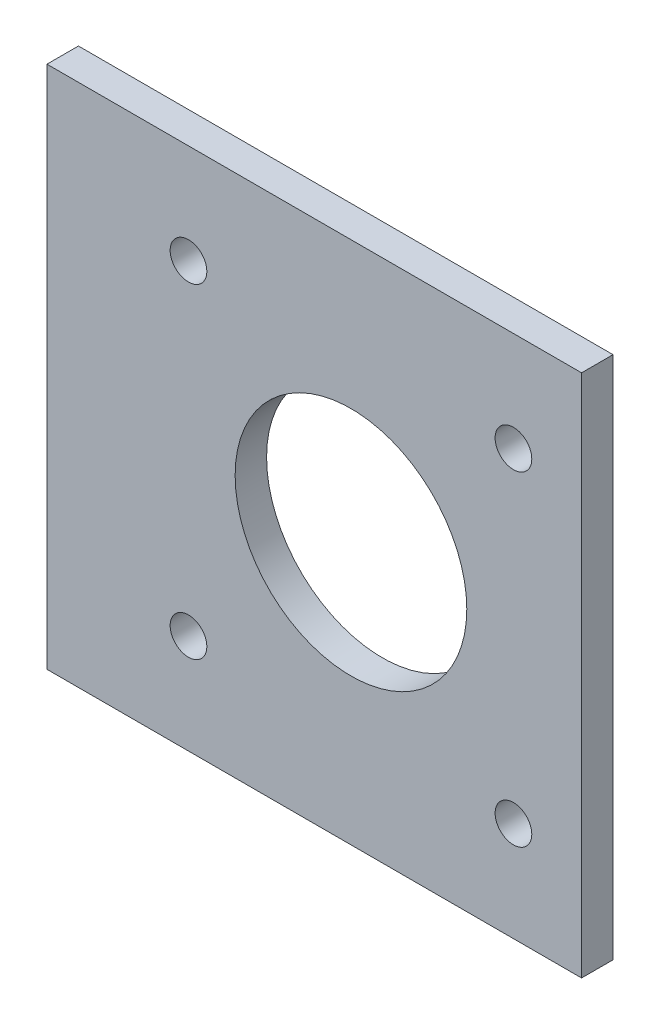
ISO-10303-21;
HEADER;
FILE_DESCRIPTION(('STEP AP214'),'2;1');
FILE_NAME('part.step','',(''),(''),'','','');
FILE_SCHEMA(('AUTOMOTIVE_DESIGN { 1 0 10303 214 1 1 1 1 }'));
ENDSEC;
DATA;
#1=APPLICATION_CONTEXT('core data for automotive mechanical design processes');
#2=APPLICATION_PROTOCOL_DEFINITION('international standard','automotive_design',2000,#1);
#3=PRODUCT_CONTEXT('',#1,'mechanical');
#4=PRODUCT('Part','Part','',(#3));
#5=PRODUCT_RELATED_PRODUCT_CATEGORY('part','',(#4));
#6=PRODUCT_DEFINITION_FORMATION('','',#4);
#7=PRODUCT_DEFINITION_CONTEXT('part definition',#1,'design');
#8=PRODUCT_DEFINITION('design','',#6,#7);
#9=PRODUCT_DEFINITION_SHAPE('','',#8);
#10=(LENGTH_UNIT() NAMED_UNIT(*) SI_UNIT(.MILLI.,.METRE.));
#11=(NAMED_UNIT(*) PLANE_ANGLE_UNIT() SI_UNIT($,.RADIAN.));
#12=(NAMED_UNIT(*) SI_UNIT($,.STERADIAN.) SOLID_ANGLE_UNIT());
#13=UNCERTAINTY_MEASURE_WITH_UNIT(LENGTH_MEASURE(1.E-05),#10,'distance_accuracy_value','');
#14=(GEOMETRIC_REPRESENTATION_CONTEXT(3) GLOBAL_UNCERTAINTY_ASSIGNED_CONTEXT((#13)) GLOBAL_UNIT_ASSIGNED_CONTEXT((#10,
#11,#12)) REPRESENTATION_CONTEXT('',''));
#15=CARTESIAN_POINT('',(0.,0.,0.));
#16=DIRECTION('',(0.,0.,1.));
#17=DIRECTION('',(1.,0.,0.));
#18=AXIS2_PLACEMENT_3D('',#15,#16,#17);
#19=CARTESIAN_POINT('',(0.,0.,3.));
#20=DIRECTION('',(0.,0.,1.));
#21=DIRECTION('',(1.,0.,0.));
#22=AXIS2_PLACEMENT_3D('',#19,#20,#21);
#23=PLANE('',#22);
#24=CARTESIAN_POINT('',(13.5,-9.5,3.));
#25=DIRECTION('',(0.,0.,1.));
#26=DIRECTION('',(1.,0.,0.));
#27=AXIS2_PLACEMENT_3D('',#24,#25,#26);
#28=CIRCLE('',#27,1.75);
#29=CARTESIAN_POINT('',(15.25,-9.5,3.));
#30=VERTEX_POINT('',#29);
#31=EDGE_CURVE('E131',#30,#30,#28,.T.);
#32=ORIENTED_EDGE('',*,*,#31,.F.);
#33=EDGE_LOOP('',(#32));
#34=FACE_BOUND('',#33,.T.);
#35=CARTESIAN_POINT('',(44.5,-40.5,3.));
#36=DIRECTION('',(0.,0.,1.));
#37=DIRECTION('',(1.,0.,0.));
#38=AXIS2_PLACEMENT_3D('',#35,#36,#37);
#39=CIRCLE('',#38,1.75);
#40=CARTESIAN_POINT('',(46.25,-40.5,3.));
#41=VERTEX_POINT('',#40);
#42=EDGE_CURVE('E119',#41,#41,#39,.T.);
#43=ORIENTED_EDGE('',*,*,#42,.F.);
#44=EDGE_LOOP('',(#43));
#45=FACE_BOUND('',#44,.T.);
#46=DIRECTION('',(0.,-1.,0.));
#47=VECTOR('',#46,1.);
#48=CARTESIAN_POINT('',(0.,0.,3.));
#49=LINE('',#48,#47);
#50=CARTESIAN_POINT('',(0.,0.,3.));
#51=VERTEX_POINT('',#50);
#52=CARTESIAN_POINT('',(0.,-50.,3.));
#53=VERTEX_POINT('',#52);
#54=EDGE_CURVE('E89',#51,#53,#49,.T.);
#55=ORIENTED_EDGE('',*,*,#54,.T.);
#56=DIRECTION('',(1.,0.,0.));
#57=VECTOR('',#56,1.);
#58=CARTESIAN_POINT('',(0.,-50.,3.));
#59=LINE('',#58,#57);
#60=CARTESIAN_POINT('',(51.,-50.,3.));
#61=VERTEX_POINT('',#60);
#62=EDGE_CURVE('E84',#53,#61,#59,.T.);
#63=ORIENTED_EDGE('',*,*,#62,.T.);
#64=DIRECTION('',(0.,1.,0.));
#65=VECTOR('',#64,1.);
#66=CARTESIAN_POINT('',(51.,0.,3.));
#67=LINE('',#66,#65);
#68=CARTESIAN_POINT('',(51.,0.,3.));
#69=VERTEX_POINT('',#68);
#70=EDGE_CURVE('E87',#61,#69,#67,.T.);
#71=ORIENTED_EDGE('',*,*,#70,.T.);
#72=DIRECTION('',(-1.,0.,0.));
#73=VECTOR('',#72,1.);
#74=CARTESIAN_POINT('',(0.,0.,3.));
#75=LINE('',#74,#73);
#76=EDGE_CURVE('E54',#69,#51,#75,.T.);
#77=ORIENTED_EDGE('',*,*,#76,.T.);
#78=EDGE_LOOP('',(#55,#63,#71,#77));
#79=FACE_BOUND('',#78,.T.);
#80=CARTESIAN_POINT('',(29.,-25.,3.));
#81=DIRECTION('',(0.,0.,1.));
#82=DIRECTION('',(1.,0.,0.));
#83=AXIS2_PLACEMENT_3D('',#80,#81,#82);
#84=CIRCLE('',#83,11.05);
#85=CARTESIAN_POINT('',(40.05,-25.,3.));
#86=VERTEX_POINT('',#85);
#87=EDGE_CURVE('E104',#86,#86,#84,.T.);
#88=ORIENTED_EDGE('',*,*,#87,.F.);
#89=EDGE_LOOP('',(#88));
#90=FACE_BOUND('',#89,.T.);
#91=CARTESIAN_POINT('',(13.5,-40.5000000000002,3.));
#92=DIRECTION('',(0.,0.,1.));
#93=DIRECTION('',(1.,0.,0.));
#94=AXIS2_PLACEMENT_3D('',#91,#92,#93);
#95=CIRCLE('',#94,1.75);
#96=CARTESIAN_POINT('',(15.25,-40.5000000000002,3.));
#97=VERTEX_POINT('',#96);
#98=EDGE_CURVE('E125',#97,#97,#95,.T.);
#99=ORIENTED_EDGE('',*,*,#98,.F.);
#100=EDGE_LOOP('',(#99));
#101=FACE_BOUND('',#100,.T.);
#102=CARTESIAN_POINT('',(44.5,-9.49999999999979,3.));
#103=DIRECTION('',(0.,0.,1.));
#104=DIRECTION('',(1.,0.,0.));
#105=AXIS2_PLACEMENT_3D('',#102,#103,#104);
#106=CIRCLE('',#105,1.75);
#107=CARTESIAN_POINT('',(46.25,-9.49999999999979,3.));
#108=VERTEX_POINT('',#107);
#109=EDGE_CURVE('E137',#108,#108,#106,.T.);
#110=ORIENTED_EDGE('',*,*,#109,.F.);
#111=EDGE_LOOP('',(#110));
#112=FACE_BOUND('',#111,.T.);
#113=ADVANCED_FACE('F37',(#34,#45,#79,#90,#101,#112),#23,.T.);
#114=CARTESIAN_POINT('',(0.,0.,0.));
#115=DIRECTION('',(0.,0.,1.));
#116=DIRECTION('',(1.,0.,0.));
#117=AXIS2_PLACEMENT_3D('',#114,#115,#116);
#118=PLANE('',#117);
#119=DIRECTION('',(0.,-1.,0.));
#120=VECTOR('',#119,1.);
#121=CARTESIAN_POINT('',(0.,0.,0.));
#122=LINE('',#121,#120);
#123=CARTESIAN_POINT('',(0.,0.,0.));
#124=VERTEX_POINT('',#123);
#125=CARTESIAN_POINT('',(0.,-50.,0.));
#126=VERTEX_POINT('',#125);
#127=EDGE_CURVE('E101',#124,#126,#122,.T.);
#128=ORIENTED_EDGE('',*,*,#127,.F.);
#129=DIRECTION('',(-1.,0.,0.));
#130=VECTOR('',#129,1.);
#131=CARTESIAN_POINT('',(0.,0.,0.));
#132=LINE('',#131,#130);
#133=CARTESIAN_POINT('',(51.,0.,0.));
#134=VERTEX_POINT('',#133);
#135=EDGE_CURVE('E77',#134,#124,#132,.T.);
#136=ORIENTED_EDGE('',*,*,#135,.F.);
#137=DIRECTION('',(0.,1.,0.));
#138=VECTOR('',#137,1.);
#139=CARTESIAN_POINT('',(51.,0.,0.));
#140=LINE('',#139,#138);
#141=CARTESIAN_POINT('',(51.,-50.,0.));
#142=VERTEX_POINT('',#141);
#143=EDGE_CURVE('E71',#142,#134,#140,.T.);
#144=ORIENTED_EDGE('',*,*,#143,.F.);
#145=DIRECTION('',(1.,0.,0.));
#146=VECTOR('',#145,1.);
#147=CARTESIAN_POINT('',(0.,-50.,0.));
#148=LINE('',#147,#146);
#149=EDGE_CURVE('E93',#126,#142,#148,.T.);
#150=ORIENTED_EDGE('',*,*,#149,.F.);
#151=EDGE_LOOP('',(#128,#136,#144,#150));
#152=FACE_BOUND('',#151,.T.);
#153=CARTESIAN_POINT('',(29.,-25.,0.));
#154=DIRECTION('',(0.,0.,1.));
#155=DIRECTION('',(1.,0.,0.));
#156=AXIS2_PLACEMENT_3D('',#153,#154,#155);
#157=CIRCLE('',#156,11.05);
#158=CARTESIAN_POINT('',(40.05,-25.,0.));
#159=VERTEX_POINT('',#158);
#160=EDGE_CURVE('E116',#159,#159,#157,.T.);
#161=ORIENTED_EDGE('',*,*,#160,.T.);
#162=EDGE_LOOP('',(#161));
#163=FACE_BOUND('',#162,.T.);
#164=CARTESIAN_POINT('',(44.5,-40.5,0.));
#165=DIRECTION('',(0.,0.,1.));
#166=DIRECTION('',(1.,0.,0.));
#167=AXIS2_PLACEMENT_3D('',#164,#165,#166);
#168=CIRCLE('',#167,1.75);
#169=CARTESIAN_POINT('',(46.25,-40.5,0.));
#170=VERTEX_POINT('',#169);
#171=EDGE_CURVE('E122',#170,#170,#168,.T.);
#172=ORIENTED_EDGE('',*,*,#171,.T.);
#173=EDGE_LOOP('',(#172));
#174=FACE_BOUND('',#173,.T.);
#175=CARTESIAN_POINT('',(13.5,-40.5000000000002,0.));
#176=DIRECTION('',(0.,0.,1.));
#177=DIRECTION('',(1.,0.,0.));
#178=AXIS2_PLACEMENT_3D('',#175,#176,#177);
#179=CIRCLE('',#178,1.75);
#180=CARTESIAN_POINT('',(15.25,-40.5000000000002,0.));
#181=VERTEX_POINT('',#180);
#182=EDGE_CURVE('E128',#181,#181,#179,.T.);
#183=ORIENTED_EDGE('',*,*,#182,.T.);
#184=EDGE_LOOP('',(#183));
#185=FACE_BOUND('',#184,.T.);
#186=CARTESIAN_POINT('',(13.5,-9.5,0.));
#187=DIRECTION('',(0.,0.,1.));
#188=DIRECTION('',(1.,0.,0.));
#189=AXIS2_PLACEMENT_3D('',#186,#187,#188);
#190=CIRCLE('',#189,1.75);
#191=CARTESIAN_POINT('',(15.25,-9.5,0.));
#192=VERTEX_POINT('',#191);
#193=EDGE_CURVE('E134',#192,#192,#190,.T.);
#194=ORIENTED_EDGE('',*,*,#193,.T.);
#195=EDGE_LOOP('',(#194));
#196=FACE_BOUND('',#195,.T.);
#197=CARTESIAN_POINT('',(44.5,-9.49999999999979,0.));
#198=DIRECTION('',(0.,0.,1.));
#199=DIRECTION('',(1.,0.,0.));
#200=AXIS2_PLACEMENT_3D('',#197,#198,#199);
#201=CIRCLE('',#200,1.75);
#202=CARTESIAN_POINT('',(46.25,-9.49999999999979,0.));
#203=VERTEX_POINT('',#202);
#204=EDGE_CURVE('E140',#203,#203,#201,.T.);
#205=ORIENTED_EDGE('',*,*,#204,.T.);
#206=EDGE_LOOP('',(#205));
#207=FACE_BOUND('',#206,.T.);
#208=ADVANCED_FACE('F112',(#152,#163,#174,#185,#196,#207),#118,.F.);
#209=CARTESIAN_POINT('',(0.,0.,3.));
#210=DIRECTION('',(1.,0.,0.));
#211=DIRECTION('',(0.,1.,0.));
#212=AXIS2_PLACEMENT_3D('',#209,#210,#211);
#213=PLANE('',#212);
#214=ORIENTED_EDGE('',*,*,#127,.T.);
#215=DIRECTION('',(0.,0.,-1.));
#216=VECTOR('',#215,1.);
#217=CARTESIAN_POINT('',(0.,-50.,3.));
#218=LINE('',#217,#216);
#219=EDGE_CURVE('E11',#53,#126,#218,.T.);
#220=ORIENTED_EDGE('',*,*,#219,.F.);
#221=ORIENTED_EDGE('',*,*,#54,.F.);
#222=DIRECTION('',(0.,0.,-1.));
#223=VECTOR('',#222,1.);
#224=CARTESIAN_POINT('',(0.,0.,3.));
#225=LINE('',#224,#223);
#226=EDGE_CURVE('E97',#51,#124,#225,.T.);
#227=ORIENTED_EDGE('',*,*,#226,.T.);
#228=EDGE_LOOP('',(#214,#220,#221,#227));
#229=FACE_BOUND('',#228,.T.);
#230=ADVANCED_FACE('F39',(#229),#213,.F.);
#231=CARTESIAN_POINT('',(0.,-50.,3.));
#232=DIRECTION('',(0.,1.,0.));
#233=DIRECTION('',(0.,0.,1.));
#234=AXIS2_PLACEMENT_3D('',#231,#232,#233);
#235=PLANE('',#234);
#236=ORIENTED_EDGE('',*,*,#149,.T.);
#237=DIRECTION('',(0.,0.,-1.));
#238=VECTOR('',#237,1.);
#239=CARTESIAN_POINT('',(51.,-50.,3.));
#240=LINE('',#239,#238);
#241=EDGE_CURVE('E46',#61,#142,#240,.T.);
#242=ORIENTED_EDGE('',*,*,#241,.F.);
#243=ORIENTED_EDGE('',*,*,#62,.F.);
#244=ORIENTED_EDGE('',*,*,#219,.T.);
#245=EDGE_LOOP('',(#236,#242,#243,#244));
#246=FACE_BOUND('',#245,.T.);
#247=ADVANCED_FACE('F92',(#246),#235,.F.);
#248=CARTESIAN_POINT('',(51.,0.,3.));
#249=DIRECTION('',(-1.,0.,0.));
#250=DIRECTION('',(0.,-1.,0.));
#251=AXIS2_PLACEMENT_3D('',#248,#249,#250);
#252=PLANE('',#251);
#253=ORIENTED_EDGE('',*,*,#143,.T.);
#254=DIRECTION('',(0.,0.,-1.));
#255=VECTOR('',#254,1.);
#256=CARTESIAN_POINT('',(51.,0.,3.));
#257=LINE('',#256,#255);
#258=EDGE_CURVE('E94',#69,#134,#257,.T.);
#259=ORIENTED_EDGE('',*,*,#258,.F.);
#260=ORIENTED_EDGE('',*,*,#70,.F.);
#261=ORIENTED_EDGE('',*,*,#241,.T.);
#262=EDGE_LOOP('',(#253,#259,#260,#261));
#263=FACE_BOUND('',#262,.T.);
#264=ADVANCED_FACE('F95',(#263),#252,.F.);
#265=CARTESIAN_POINT('',(0.,0.,3.));
#266=DIRECTION('',(0.,-1.,0.));
#267=DIRECTION('',(0.,0.,-1.));
#268=AXIS2_PLACEMENT_3D('',#265,#266,#267);
#269=PLANE('',#268);
#270=ORIENTED_EDGE('',*,*,#135,.T.);
#271=ORIENTED_EDGE('',*,*,#226,.F.);
#272=ORIENTED_EDGE('',*,*,#76,.F.);
#273=ORIENTED_EDGE('',*,*,#258,.T.);
#274=EDGE_LOOP('',(#270,#271,#272,#273));
#275=FACE_BOUND('',#274,.T.);
#276=ADVANCED_FACE('F109',(#275),#269,.F.);
#277=CARTESIAN_POINT('',(29.,-25.,3.));
#278=DIRECTION('',(0.,0.,-1.));
#279=DIRECTION('',(-1.,0.,0.));
#280=AXIS2_PLACEMENT_3D('',#277,#278,#279);
#281=CYLINDRICAL_SURFACE('',#280,11.05);
#282=ORIENTED_EDGE('',*,*,#87,.T.);
#283=EDGE_LOOP('',(#282));
#284=FACE_BOUND('',#283,.T.);
#285=ORIENTED_EDGE('',*,*,#160,.F.);
#286=EDGE_LOOP('',(#285));
#287=FACE_BOUND('',#286,.T.);
#288=ADVANCED_FACE('F159',(#284,#287),#281,.F.);
#289=CARTESIAN_POINT('',(44.5,-40.5,3.));
#290=DIRECTION('',(0.,0.,-1.));
#291=DIRECTION('',(-1.,0.,0.));
#292=AXIS2_PLACEMENT_3D('',#289,#290,#291);
#293=CYLINDRICAL_SURFACE('',#292,1.75);
#294=ORIENTED_EDGE('',*,*,#42,.T.);
#295=EDGE_LOOP('',(#294));
#296=FACE_BOUND('',#295,.T.);
#297=ORIENTED_EDGE('',*,*,#171,.F.);
#298=EDGE_LOOP('',(#297));
#299=FACE_BOUND('',#298,.T.);
#300=ADVANCED_FACE('F205',(#296,#299),#293,.F.);
#301=CARTESIAN_POINT('',(13.5,-40.5000000000002,3.));
#302=DIRECTION('',(0.,0.,-1.));
#303=DIRECTION('',(-1.,0.,0.));
#304=AXIS2_PLACEMENT_3D('',#301,#302,#303);
#305=CYLINDRICAL_SURFACE('',#304,1.75);
#306=ORIENTED_EDGE('',*,*,#98,.T.);
#307=EDGE_LOOP('',(#306));
#308=FACE_BOUND('',#307,.T.);
#309=ORIENTED_EDGE('',*,*,#182,.F.);
#310=EDGE_LOOP('',(#309));
#311=FACE_BOUND('',#310,.T.);
#312=ADVANCED_FACE('F213',(#308,#311),#305,.F.);
#313=CARTESIAN_POINT('',(13.5,-9.5,3.));
#314=DIRECTION('',(0.,0.,-1.));
#315=DIRECTION('',(-1.,0.,0.));
#316=AXIS2_PLACEMENT_3D('',#313,#314,#315);
#317=CYLINDRICAL_SURFACE('',#316,1.75);
#318=ORIENTED_EDGE('',*,*,#31,.T.);
#319=EDGE_LOOP('',(#318));
#320=FACE_BOUND('',#319,.T.);
#321=ORIENTED_EDGE('',*,*,#193,.F.);
#322=EDGE_LOOP('',(#321));
#323=FACE_BOUND('',#322,.T.);
#324=ADVANCED_FACE('F221',(#320,#323),#317,.F.);
#325=CARTESIAN_POINT('',(44.5,-9.49999999999979,3.));
#326=DIRECTION('',(0.,0.,-1.));
#327=DIRECTION('',(-1.,0.,0.));
#328=AXIS2_PLACEMENT_3D('',#325,#326,#327);
#329=CYLINDRICAL_SURFACE('',#328,1.75);
#330=ORIENTED_EDGE('',*,*,#109,.T.);
#331=EDGE_LOOP('',(#330));
#332=FACE_BOUND('',#331,.T.);
#333=ORIENTED_EDGE('',*,*,#204,.F.);
#334=EDGE_LOOP('',(#333));
#335=FACE_BOUND('',#334,.T.);
#336=ADVANCED_FACE('F146',(#332,#335),#329,.F.);
#337=CLOSED_SHELL('',(#113,#208,#230,#247,#264,#276,#288,#300,#312,#324,#336));
#338=MANIFOLD_SOLID_BREP('B2',#337);
#339=ADVANCED_BREP_SHAPE_REPRESENTATION('',(#18,#338),#14);
#340=SHAPE_DEFINITION_REPRESENTATION(#9,#339);
ENDSEC;
END-ISO-10303-21;
